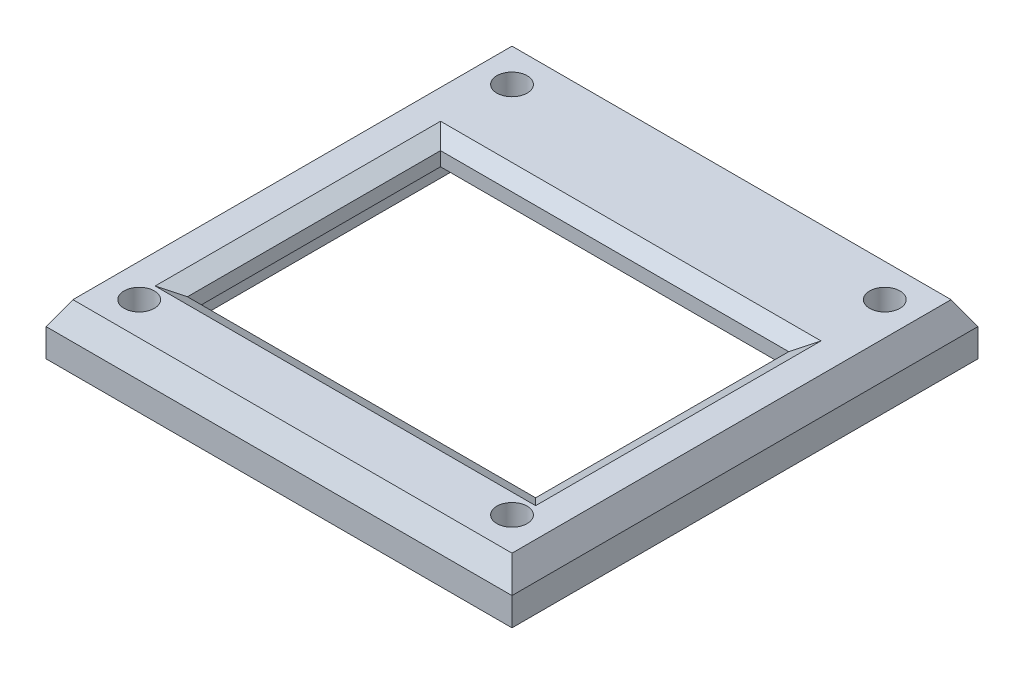
ISO-10303-21;
HEADER;
FILE_DESCRIPTION(('STEP AP214'),'2;1');
FILE_NAME('part.step','',(''),(''),'','','');
FILE_SCHEMA(('AUTOMOTIVE_DESIGN { 1 0 10303 214 1 1 1 1 }'));
ENDSEC;
DATA;
#1=APPLICATION_CONTEXT('core data for automotive mechanical design processes');
#2=APPLICATION_PROTOCOL_DEFINITION('international standard','automotive_design',2000,#1);
#3=PRODUCT_CONTEXT('',#1,'mechanical');
#4=PRODUCT('Part','Part','',(#3));
#5=PRODUCT_RELATED_PRODUCT_CATEGORY('part','',(#4));
#6=PRODUCT_DEFINITION_FORMATION('','',#4);
#7=PRODUCT_DEFINITION_CONTEXT('part definition',#1,'design');
#8=PRODUCT_DEFINITION('design','',#6,#7);
#9=PRODUCT_DEFINITION_SHAPE('','',#8);
#10=(LENGTH_UNIT() NAMED_UNIT(*) SI_UNIT(.MILLI.,.METRE.));
#11=(NAMED_UNIT(*) PLANE_ANGLE_UNIT() SI_UNIT($,.RADIAN.));
#12=(NAMED_UNIT(*) SI_UNIT($,.STERADIAN.) SOLID_ANGLE_UNIT());
#13=UNCERTAINTY_MEASURE_WITH_UNIT(LENGTH_MEASURE(1.E-05),#10,'distance_accuracy_value','');
#14=(GEOMETRIC_REPRESENTATION_CONTEXT(3) GLOBAL_UNCERTAINTY_ASSIGNED_CONTEXT((#13)) GLOBAL_UNIT_ASSIGNED_CONTEXT((#10,
#11,#12)) REPRESENTATION_CONTEXT('',''));
#15=CARTESIAN_POINT('',(0.,0.,0.));
#16=DIRECTION('',(0.,0.,1.));
#17=DIRECTION('',(1.,0.,0.));
#18=AXIS2_PLACEMENT_3D('',#15,#16,#17);
#19=CARTESIAN_POINT('',(0.,3.,-17.475));
#20=DIRECTION('',(0.,0.,-1.));
#21=DIRECTION('',(-1.,0.,0.));
#22=AXIS2_PLACEMENT_3D('',#19,#20,#21);
#23=PLANE('',#22);
#24=DIRECTION('',(1.,0.,0.));
#25=VECTOR('',#24,1.);
#26=CARTESIAN_POINT('',(0.,0.,-17.475));
#27=LINE('',#26,#25);
#28=CARTESIAN_POINT('',(-20.625,0.,-17.475));
#29=VERTEX_POINT('',#28);
#30=CARTESIAN_POINT('',(20.625,0.,-17.475));
#31=VERTEX_POINT('',#30);
#32=EDGE_CURVE('E233',#29,#31,#27,.T.);
#33=ORIENTED_EDGE('',*,*,#32,.T.);
#34=DIRECTION('',(0.,-1.,0.));
#35=VECTOR('',#34,1.);
#36=CARTESIAN_POINT('',(20.625,3.,-17.475));
#37=LINE('',#36,#35);
#38=CARTESIAN_POINT('',(20.625,3.,-17.475));
#39=VERTEX_POINT('',#38);
#40=EDGE_CURVE('E251',#39,#31,#37,.T.);
#41=ORIENTED_EDGE('',*,*,#40,.F.);
#42=DIRECTION('',(1.,0.,0.));
#43=VECTOR('',#42,1.);
#44=CARTESIAN_POINT('',(0.,3.,-17.475));
#45=LINE('',#44,#43);
#46=CARTESIAN_POINT('',(-20.625,3.,-17.475));
#47=VERTEX_POINT('',#46);
#48=EDGE_CURVE('E200',#47,#39,#45,.T.);
#49=ORIENTED_EDGE('',*,*,#48,.F.);
#50=DIRECTION('',(0.,-1.,0.));
#51=VECTOR('',#50,1.);
#52=CARTESIAN_POINT('',(-20.625,3.,-17.475));
#53=LINE('',#52,#51);
#54=EDGE_CURVE('E244',#47,#29,#53,.T.);
#55=ORIENTED_EDGE('',*,*,#54,.T.);
#56=EDGE_LOOP('',(#33,#41,#49,#55));
#57=FACE_BOUND('',#56,.T.);
#58=ADVANCED_FACE('F35',(#57),#23,.F.);
#59=CARTESIAN_POINT('',(20.625,3.,0.));
#60=DIRECTION('',(1.,0.,0.));
#61=DIRECTION('',(0.,0.,-1.));
#62=AXIS2_PLACEMENT_3D('',#59,#60,#61);
#63=PLANE('',#62);
#64=DIRECTION('',(0.,0.,1.));
#65=VECTOR('',#64,1.);
#66=CARTESIAN_POINT('',(20.625,0.,0.));
#67=LINE('',#66,#65);
#68=CARTESIAN_POINT('',(20.625,0.,16.775));
#69=VERTEX_POINT('',#68);
#70=EDGE_CURVE('E236',#31,#69,#67,.T.);
#71=ORIENTED_EDGE('',*,*,#70,.T.);
#72=DIRECTION('',(0.,-1.,0.));
#73=VECTOR('',#72,1.);
#74=CARTESIAN_POINT('',(20.625,3.,16.775));
#75=LINE('',#74,#73);
#76=CARTESIAN_POINT('',(20.625,3.,16.775));
#77=VERTEX_POINT('',#76);
#78=EDGE_CURVE('E249',#77,#69,#75,.T.);
#79=ORIENTED_EDGE('',*,*,#78,.F.);
#80=DIRECTION('',(0.,0.,1.));
#81=VECTOR('',#80,1.);
#82=CARTESIAN_POINT('',(20.625,3.,0.));
#83=LINE('',#82,#81);
#84=EDGE_CURVE('E202',#39,#77,#83,.T.);
#85=ORIENTED_EDGE('',*,*,#84,.F.);
#86=ORIENTED_EDGE('',*,*,#40,.T.);
#87=EDGE_LOOP('',(#71,#79,#85,#86));
#88=FACE_BOUND('',#87,.T.);
#89=ADVANCED_FACE('F327',(#88),#63,.F.);
#90=CARTESIAN_POINT('',(0.,3.,16.775));
#91=DIRECTION('',(0.,0.,-1.));
#92=DIRECTION('',(-1.,0.,0.));
#93=AXIS2_PLACEMENT_3D('',#90,#91,#92);
#94=PLANE('',#93);
#95=DIRECTION('',(1.,0.,0.));
#96=VECTOR('',#95,1.);
#97=CARTESIAN_POINT('',(0.,0.,16.775));
#98=LINE('',#97,#96);
#99=CARTESIAN_POINT('',(-20.625,0.,16.775));
#100=VERTEX_POINT('',#99);
#101=EDGE_CURVE('E239',#100,#69,#98,.T.);
#102=ORIENTED_EDGE('',*,*,#101,.F.);
#103=DIRECTION('',(0.,-1.,0.));
#104=VECTOR('',#103,1.);
#105=CARTESIAN_POINT('',(-20.625,3.,16.775));
#106=LINE('',#105,#104);
#107=CARTESIAN_POINT('',(-20.625,3.,16.775));
#108=VERTEX_POINT('',#107);
#109=EDGE_CURVE('E246',#108,#100,#106,.T.);
#110=ORIENTED_EDGE('',*,*,#109,.F.);
#111=DIRECTION('',(1.,0.,0.));
#112=VECTOR('',#111,1.);
#113=CARTESIAN_POINT('',(0.,3.,16.775));
#114=LINE('',#113,#112);
#115=EDGE_CURVE('E204',#108,#77,#114,.T.);
#116=ORIENTED_EDGE('',*,*,#115,.T.);
#117=ORIENTED_EDGE('',*,*,#78,.T.);
#118=EDGE_LOOP('',(#102,#110,#116,#117));
#119=FACE_BOUND('',#118,.T.);
#120=ADVANCED_FACE('F333',(#119),#94,.T.);
#121=CARTESIAN_POINT('',(25.,3.,0.));
#122=DIRECTION('',(1.,0.,0.));
#123=DIRECTION('',(0.,0.,-1.));
#124=AXIS2_PLACEMENT_3D('',#121,#122,#123);
#125=PLANE('',#124);
#126=DIRECTION('',(0.,0.,1.));
#127=VECTOR('',#126,1.);
#128=CARTESIAN_POINT('',(25.,0.,0.));
#129=LINE('',#128,#127);
#130=CARTESIAN_POINT('',(25.,0.,-25.));
#131=VERTEX_POINT('',#130);
#132=CARTESIAN_POINT('',(25.,0.,25.));
#133=VERTEX_POINT('',#132);
#134=EDGE_CURVE('E159',#131,#133,#129,.T.);
#135=ORIENTED_EDGE('',*,*,#134,.F.);
#136=DIRECTION('',(0.,-1.,0.));
#137=VECTOR('',#136,1.);
#138=CARTESIAN_POINT('',(25.,3.,-25.));
#139=LINE('',#138,#137);
#140=CARTESIAN_POINT('',(25.,3.,-25.));
#141=VERTEX_POINT('',#140);
#142=EDGE_CURVE('E247',#141,#131,#139,.T.);
#143=ORIENTED_EDGE('',*,*,#142,.F.);
#144=DIRECTION('',(0.,0.,1.));
#145=VECTOR('',#144,1.);
#146=CARTESIAN_POINT('',(25.,3.,0.));
#147=LINE('',#146,#145);
#148=CARTESIAN_POINT('',(25.,3.,25.));
#149=VERTEX_POINT('',#148);
#150=EDGE_CURVE('E187',#141,#149,#147,.T.);
#151=ORIENTED_EDGE('',*,*,#150,.T.);
#152=DIRECTION('',(0.,-1.,0.));
#153=VECTOR('',#152,1.);
#154=CARTESIAN_POINT('',(25.,3.,25.));
#155=LINE('',#154,#153);
#156=EDGE_CURVE('E210',#149,#133,#155,.T.);
#157=ORIENTED_EDGE('',*,*,#156,.T.);
#158=EDGE_LOOP('',(#135,#143,#151,#157));
#159=FACE_BOUND('',#158,.T.);
#160=ADVANCED_FACE('F366',(#159),#125,.T.);
#161=CARTESIAN_POINT('',(0.,3.,-25.));
#162=DIRECTION('',(0.,0.,-1.));
#163=DIRECTION('',(-1.,0.,0.));
#164=AXIS2_PLACEMENT_3D('',#161,#162,#163);
#165=PLANE('',#164);
#166=DIRECTION('',(1.,0.,0.));
#167=VECTOR('',#166,1.);
#168=CARTESIAN_POINT('',(0.,0.,-25.));
#169=LINE('',#168,#167);
#170=CARTESIAN_POINT('',(-25.,0.,-25.));
#171=VERTEX_POINT('',#170);
#172=EDGE_CURVE('E213',#171,#131,#169,.T.);
#173=ORIENTED_EDGE('',*,*,#172,.F.);
#174=DIRECTION('',(0.,-1.,0.));
#175=VECTOR('',#174,1.);
#176=CARTESIAN_POINT('',(-25.,3.,-25.));
#177=LINE('',#176,#175);
#178=CARTESIAN_POINT('',(-25.,3.,-25.));
#179=VERTEX_POINT('',#178);
#180=EDGE_CURVE('E259',#179,#171,#177,.T.);
#181=ORIENTED_EDGE('',*,*,#180,.F.);
#182=DIRECTION('',(1.,0.,0.));
#183=VECTOR('',#182,1.);
#184=CARTESIAN_POINT('',(0.,3.,-25.));
#185=LINE('',#184,#183);
#186=EDGE_CURVE('E190',#179,#141,#185,.T.);
#187=ORIENTED_EDGE('',*,*,#186,.T.);
#188=ORIENTED_EDGE('',*,*,#142,.T.);
#189=EDGE_LOOP('',(#173,#181,#187,#188));
#190=FACE_BOUND('',#189,.T.);
#191=ADVANCED_FACE('F362',(#190),#165,.T.);
#192=CARTESIAN_POINT('',(-25.,3.,0.));
#193=DIRECTION('',(1.,0.,0.));
#194=DIRECTION('',(0.,0.,-1.));
#195=AXIS2_PLACEMENT_3D('',#192,#193,#194);
#196=PLANE('',#195);
#197=DIRECTION('',(0.,0.,1.));
#198=VECTOR('',#197,1.);
#199=CARTESIAN_POINT('',(-25.,0.,0.));
#200=LINE('',#199,#198);
#201=CARTESIAN_POINT('',(-25.,0.,25.));
#202=VERTEX_POINT('',#201);
#203=EDGE_CURVE('E216',#171,#202,#200,.T.);
#204=ORIENTED_EDGE('',*,*,#203,.T.);
#205=DIRECTION('',(0.,-1.,0.));
#206=VECTOR('',#205,1.);
#207=CARTESIAN_POINT('',(-25.,3.,25.));
#208=LINE('',#207,#206);
#209=CARTESIAN_POINT('',(-25.,3.,25.));
#210=VERTEX_POINT('',#209);
#211=EDGE_CURVE('E256',#210,#202,#208,.T.);
#212=ORIENTED_EDGE('',*,*,#211,.F.);
#213=DIRECTION('',(0.,0.,1.));
#214=VECTOR('',#213,1.);
#215=CARTESIAN_POINT('',(-25.,3.,0.));
#216=LINE('',#215,#214);
#217=EDGE_CURVE('E194',#179,#210,#216,.T.);
#218=ORIENTED_EDGE('',*,*,#217,.F.);
#219=ORIENTED_EDGE('',*,*,#180,.T.);
#220=EDGE_LOOP('',(#204,#212,#218,#219));
#221=FACE_BOUND('',#220,.T.);
#222=ADVANCED_FACE('F342',(#221),#196,.F.);
#223=CARTESIAN_POINT('',(-20.,3.,-20.));
#224=DIRECTION('',(0.,-1.,0.));
#225=DIRECTION('',(0.,0.,-1.));
#226=AXIS2_PLACEMENT_3D('',#223,#224,#225);
#227=CYLINDRICAL_SURFACE('',#226,1.625);
#228=CARTESIAN_POINT('',(-20.,0.,-20.));
#229=DIRECTION('',(0.,1.,0.));
#230=DIRECTION('',(0.,0.,1.));
#231=AXIS2_PLACEMENT_3D('',#228,#229,#230);
#232=CIRCLE('',#231,1.625);
#233=CARTESIAN_POINT('',(-20.,0.,-18.375));
#234=VERTEX_POINT('',#233);
#235=EDGE_CURVE('E230',#234,#234,#232,.T.);
#236=ORIENTED_EDGE('',*,*,#235,.F.);
#237=EDGE_LOOP('',(#236));
#238=FACE_BOUND('',#237,.T.);
#239=CARTESIAN_POINT('',(-20.,5.5,-20.));
#240=DIRECTION('',(0.,1.,0.));
#241=DIRECTION('',(0.,0.,1.));
#242=AXIS2_PLACEMENT_3D('',#239,#240,#241);
#243=CIRCLE('',#242,1.625);
#244=CARTESIAN_POINT('',(-20.,5.5,-18.375));
#245=VERTEX_POINT('',#244);
#246=EDGE_CURVE('E184',#245,#245,#243,.T.);
#247=ORIENTED_EDGE('',*,*,#246,.T.);
#248=EDGE_LOOP('',(#247));
#249=FACE_BOUND('',#248,.T.);
#250=ADVANCED_FACE('F338',(#238,#249),#227,.F.);
#251=CARTESIAN_POINT('',(20.,3.,-20.));
#252=DIRECTION('',(0.,-1.,0.));
#253=DIRECTION('',(0.,0.,-1.));
#254=AXIS2_PLACEMENT_3D('',#251,#252,#253);
#255=CYLINDRICAL_SURFACE('',#254,1.625);
#256=CARTESIAN_POINT('',(20.,0.,-20.));
#257=DIRECTION('',(0.,1.,0.));
#258=DIRECTION('',(0.,0.,1.));
#259=AXIS2_PLACEMENT_3D('',#256,#257,#258);
#260=CIRCLE('',#259,1.625);
#261=CARTESIAN_POINT('',(20.,0.,-18.375));
#262=VERTEX_POINT('',#261);
#263=EDGE_CURVE('E227',#262,#262,#260,.T.);
#264=ORIENTED_EDGE('',*,*,#263,.F.);
#265=EDGE_LOOP('',(#264));
#266=FACE_BOUND('',#265,.T.);
#267=CARTESIAN_POINT('',(20.,5.5,-20.));
#268=DIRECTION('',(0.,1.,0.));
#269=DIRECTION('',(0.,0.,1.));
#270=AXIS2_PLACEMENT_3D('',#267,#268,#269);
#271=CIRCLE('',#270,1.625);
#272=CARTESIAN_POINT('',(20.,5.5,-18.375));
#273=VERTEX_POINT('',#272);
#274=EDGE_CURVE('E580',#273,#273,#271,.T.);
#275=ORIENTED_EDGE('',*,*,#274,.T.);
#276=EDGE_LOOP('',(#275));
#277=FACE_BOUND('',#276,.T.);
#278=ADVANCED_FACE('F341',(#266,#277),#255,.F.);
#279=CARTESIAN_POINT('',(20.,3.,20.));
#280=DIRECTION('',(0.,-1.,0.));
#281=DIRECTION('',(0.,0.,-1.));
#282=AXIS2_PLACEMENT_3D('',#279,#280,#281);
#283=CYLINDRICAL_SURFACE('',#282,1.625);
#284=CARTESIAN_POINT('',(20.,0.,20.));
#285=DIRECTION('',(0.,1.,0.));
#286=DIRECTION('',(0.,0.,1.));
#287=AXIS2_PLACEMENT_3D('',#284,#285,#286);
#288=CIRCLE('',#287,1.625);
#289=CARTESIAN_POINT('',(20.,0.,21.625));
#290=VERTEX_POINT('',#289);
#291=EDGE_CURVE('E224',#290,#290,#288,.T.);
#292=ORIENTED_EDGE('',*,*,#291,.F.);
#293=EDGE_LOOP('',(#292));
#294=FACE_BOUND('',#293,.T.);
#295=CARTESIAN_POINT('',(20.,5.5,20.));
#296=DIRECTION('',(0.,1.,0.));
#297=DIRECTION('',(0.,0.,1.));
#298=AXIS2_PLACEMENT_3D('',#295,#296,#297);
#299=CIRCLE('',#298,1.625);
#300=CARTESIAN_POINT('',(20.,5.5,21.625));
#301=VERTEX_POINT('',#300);
#302=EDGE_CURVE('E582',#301,#301,#299,.T.);
#303=ORIENTED_EDGE('',*,*,#302,.T.);
#304=EDGE_LOOP('',(#303));
#305=FACE_BOUND('',#304,.T.);
#306=ADVANCED_FACE('F346',(#294,#305),#283,.F.);
#307=CARTESIAN_POINT('',(-20.,3.,20.));
#308=DIRECTION('',(0.,-1.,0.));
#309=DIRECTION('',(0.,0.,-1.));
#310=AXIS2_PLACEMENT_3D('',#307,#308,#309);
#311=CYLINDRICAL_SURFACE('',#310,1.625);
#312=CARTESIAN_POINT('',(-20.,0.,20.));
#313=DIRECTION('',(0.,1.,0.));
#314=DIRECTION('',(0.,0.,1.));
#315=AXIS2_PLACEMENT_3D('',#312,#313,#314);
#316=CIRCLE('',#315,1.625);
#317=CARTESIAN_POINT('',(-20.,0.,21.625));
#318=VERTEX_POINT('',#317);
#319=EDGE_CURVE('E221',#318,#318,#316,.T.);
#320=ORIENTED_EDGE('',*,*,#319,.F.);
#321=EDGE_LOOP('',(#320));
#322=FACE_BOUND('',#321,.T.);
#323=CARTESIAN_POINT('',(-20.,5.5,20.));
#324=DIRECTION('',(0.,1.,0.));
#325=DIRECTION('',(0.,0.,1.));
#326=AXIS2_PLACEMENT_3D('',#323,#324,#325);
#327=CIRCLE('',#326,1.625);
#328=CARTESIAN_POINT('',(-20.,5.5,21.625));
#329=VERTEX_POINT('',#328);
#330=EDGE_CURVE('E181',#329,#329,#327,.T.);
#331=ORIENTED_EDGE('',*,*,#330,.T.);
#332=EDGE_LOOP('',(#331));
#333=FACE_BOUND('',#332,.T.);
#334=ADVANCED_FACE('F350',(#322,#333),#311,.F.);
#335=CARTESIAN_POINT('',(0.,3.,25.));
#336=DIRECTION('',(0.,0.,-1.));
#337=DIRECTION('',(-1.,0.,0.));
#338=AXIS2_PLACEMENT_3D('',#335,#336,#337);
#339=PLANE('',#338);
#340=DIRECTION('',(1.,0.,0.));
#341=VECTOR('',#340,1.);
#342=CARTESIAN_POINT('',(0.,0.,25.));
#343=LINE('',#342,#341);
#344=EDGE_CURVE('E218',#202,#133,#343,.T.);
#345=ORIENTED_EDGE('',*,*,#344,.T.);
#346=ORIENTED_EDGE('',*,*,#156,.F.);
#347=DIRECTION('',(1.,0.,0.));
#348=VECTOR('',#347,1.);
#349=CARTESIAN_POINT('',(0.,3.,25.));
#350=LINE('',#349,#348);
#351=EDGE_CURVE('E197',#210,#149,#350,.T.);
#352=ORIENTED_EDGE('',*,*,#351,.F.);
#353=ORIENTED_EDGE('',*,*,#211,.T.);
#354=EDGE_LOOP('',(#345,#346,#352,#353));
#355=FACE_BOUND('',#354,.T.);
#356=ADVANCED_FACE('F354',(#355),#339,.F.);
#357=CARTESIAN_POINT('',(-20.625,3.,0.));
#358=DIRECTION('',(1.,0.,0.));
#359=DIRECTION('',(0.,0.,-1.));
#360=AXIS2_PLACEMENT_3D('',#357,#358,#359);
#361=PLANE('',#360);
#362=DIRECTION('',(0.,0.,1.));
#363=VECTOR('',#362,1.);
#364=CARTESIAN_POINT('',(-20.625,0.,0.));
#365=LINE('',#364,#363);
#366=EDGE_CURVE('E191',#29,#100,#365,.T.);
#367=ORIENTED_EDGE('',*,*,#366,.F.);
#368=ORIENTED_EDGE('',*,*,#54,.F.);
#369=DIRECTION('',(0.,0.,1.));
#370=VECTOR('',#369,1.);
#371=CARTESIAN_POINT('',(-20.625,3.,0.));
#372=LINE('',#371,#370);
#373=EDGE_CURVE('E207',#47,#108,#372,.T.);
#374=ORIENTED_EDGE('',*,*,#373,.T.);
#375=ORIENTED_EDGE('',*,*,#109,.T.);
#376=EDGE_LOOP('',(#367,#368,#374,#375));
#377=FACE_BOUND('',#376,.T.);
#378=ADVANCED_FACE('F358',(#377),#361,.T.);
#379=CARTESIAN_POINT('',(0.,0.,0.));
#380=DIRECTION('',(0.,1.,0.));
#381=DIRECTION('',(0.,0.,1.));
#382=AXIS2_PLACEMENT_3D('',#379,#380,#381);
#383=PLANE('',#382);
#384=ORIENTED_EDGE('',*,*,#134,.T.);
#385=ORIENTED_EDGE('',*,*,#344,.F.);
#386=ORIENTED_EDGE('',*,*,#203,.F.);
#387=ORIENTED_EDGE('',*,*,#172,.T.);
#388=EDGE_LOOP('',(#384,#385,#386,#387));
#389=FACE_BOUND('',#388,.T.);
#390=ORIENTED_EDGE('',*,*,#319,.T.);
#391=EDGE_LOOP('',(#390));
#392=FACE_BOUND('',#391,.T.);
#393=ORIENTED_EDGE('',*,*,#291,.T.);
#394=EDGE_LOOP('',(#393));
#395=FACE_BOUND('',#394,.T.);
#396=ORIENTED_EDGE('',*,*,#263,.T.);
#397=EDGE_LOOP('',(#396));
#398=FACE_BOUND('',#397,.T.);
#399=ORIENTED_EDGE('',*,*,#235,.T.);
#400=EDGE_LOOP('',(#399));
#401=FACE_BOUND('',#400,.T.);
#402=ORIENTED_EDGE('',*,*,#32,.F.);
#403=ORIENTED_EDGE('',*,*,#366,.T.);
#404=ORIENTED_EDGE('',*,*,#101,.T.);
#405=ORIENTED_EDGE('',*,*,#70,.F.);
#406=EDGE_LOOP('',(#402,#403,#404,#405));
#407=FACE_BOUND('',#406,.T.);
#408=ADVANCED_FACE('F451',(#389,#392,#395,#398,#401,#407),#383,.F.);
#409=CARTESIAN_POINT('',(0.,3.,0.));
#410=DIRECTION('',(0.,1.,0.));
#411=DIRECTION('',(0.,0.,1.));
#412=AXIS2_PLACEMENT_3D('',#409,#410,#411);
#413=PLANE('',#412);
#414=DIRECTION('',(0.,0.,1.));
#415=VECTOR('',#414,1.);
#416=CARTESIAN_POINT('',(-18.6812981483655,3.,0.));
#417=LINE('',#416,#415);
#418=CARTESIAN_POINT('',(-18.6812981483655,3.,-11.0120511529388));
#419=VERTEX_POINT('',#418);
#420=CARTESIAN_POINT('',(-18.6812981483655,3.,16.145625286935));
#421=VERTEX_POINT('',#420);
#422=EDGE_CURVE('E163',#419,#421,#417,.T.);
#423=ORIENTED_EDGE('',*,*,#422,.T.);
#424=DIRECTION('',(-1.,0.,0.));
#425=VECTOR('',#424,1.);
#426=CARTESIAN_POINT('',(0.,3.,16.145625286935));
#427=LINE('',#426,#425);
#428=CARTESIAN_POINT('',(18.6812981483655,3.,16.145625286935));
#429=VERTEX_POINT('',#428);
#430=EDGE_CURVE('E176',#429,#421,#427,.T.);
#431=ORIENTED_EDGE('',*,*,#430,.F.);
#432=DIRECTION('',(0.,0.,-1.));
#433=VECTOR('',#432,1.);
#434=CARTESIAN_POINT('',(18.6812981483655,3.,0.));
#435=LINE('',#434,#433);
#436=CARTESIAN_POINT('',(18.6812981483655,3.,-11.0120511529388));
#437=VERTEX_POINT('',#436);
#438=EDGE_CURVE('E174',#429,#437,#435,.T.);
#439=ORIENTED_EDGE('',*,*,#438,.T.);
#440=DIRECTION('',(-1.,0.,0.));
#441=VECTOR('',#440,1.);
#442=CARTESIAN_POINT('',(0.,3.,-11.0120511529388));
#443=LINE('',#442,#441);
#444=EDGE_CURVE('E152',#437,#419,#443,.T.);
#445=ORIENTED_EDGE('',*,*,#444,.T.);
#446=EDGE_LOOP('',(#423,#431,#439,#445));
#447=FACE_BOUND('',#446,.T.);
#448=ORIENTED_EDGE('',*,*,#373,.F.);
#449=ORIENTED_EDGE('',*,*,#48,.T.);
#450=ORIENTED_EDGE('',*,*,#84,.T.);
#451=ORIENTED_EDGE('',*,*,#115,.F.);
#452=EDGE_LOOP('',(#448,#449,#450,#451));
#453=FACE_BOUND('',#452,.T.);
#454=ADVANCED_FACE('F171',(#447,#453),#413,.F.);
#455=CARTESIAN_POINT('',(-18.6812981483655,5.5,0.));
#456=DIRECTION('',(1.,0.,0.));
#457=DIRECTION('',(0.,0.,-1.));
#458=AXIS2_PLACEMENT_3D('',#455,#456,#457);
#459=PLANE('',#458);
#460=DIRECTION('',(0.,-1.,0.));
#461=VECTOR('',#460,1.);
#462=CARTESIAN_POINT('',(-18.6812981483655,5.5,-11.0120511529388));
#463=LINE('',#462,#461);
#464=CARTESIAN_POINT('',(-18.6812981483655,4.5,-11.0120511529388));
#465=VERTEX_POINT('',#464);
#466=EDGE_CURVE('E148',#465,#419,#463,.T.);
#467=ORIENTED_EDGE('',*,*,#466,.F.);
#468=DIRECTION('',(0.,0.,1.));
#469=VECTOR('',#468,1.);
#470=CARTESIAN_POINT('',(-18.6812981483655,4.5,0.));
#471=LINE('',#470,#469);
#472=CARTESIAN_POINT('',(-18.6812981483655,4.5,16.145625286935));
#473=VERTEX_POINT('',#472);
#474=EDGE_CURVE('E270',#465,#473,#471,.T.);
#475=ORIENTED_EDGE('',*,*,#474,.T.);
#476=DIRECTION('',(0.,-1.,0.));
#477=VECTOR('',#476,1.);
#478=CARTESIAN_POINT('',(-18.6812981483655,5.5,16.145625286935));
#479=LINE('',#478,#477);
#480=EDGE_CURVE('E165',#473,#421,#479,.T.);
#481=ORIENTED_EDGE('',*,*,#480,.T.);
#482=ORIENTED_EDGE('',*,*,#422,.F.);
#483=EDGE_LOOP('',(#467,#475,#481,#482));
#484=FACE_BOUND('',#483,.T.);
#485=ADVANCED_FACE('F164',(#484),#459,.T.);
#486=CARTESIAN_POINT('',(0.,5.5,-11.0120511529388));
#487=DIRECTION('',(0.,0.,1.));
#488=DIRECTION('',(1.,0.,0.));
#489=AXIS2_PLACEMENT_3D('',#486,#487,#488);
#490=PLANE('',#489);
#491=DIRECTION('',(0.,-1.,0.));
#492=VECTOR('',#491,1.);
#493=CARTESIAN_POINT('',(18.6812981483655,5.5,-11.0120511529388));
#494=LINE('',#493,#492);
#495=CARTESIAN_POINT('',(18.6812981483655,4.5,-11.0120511529388));
#496=VERTEX_POINT('',#495);
#497=EDGE_CURVE('E160',#496,#437,#494,.T.);
#498=ORIENTED_EDGE('',*,*,#497,.F.);
#499=DIRECTION('',(-1.,0.,0.));
#500=VECTOR('',#499,1.);
#501=CARTESIAN_POINT('',(0.,4.5,-11.0120511529388));
#502=LINE('',#501,#500);
#503=EDGE_CURVE('E155',#496,#465,#502,.T.);
#504=ORIENTED_EDGE('',*,*,#503,.T.);
#505=ORIENTED_EDGE('',*,*,#466,.T.);
#506=ORIENTED_EDGE('',*,*,#444,.F.);
#507=EDGE_LOOP('',(#498,#504,#505,#506));
#508=FACE_BOUND('',#507,.T.);
#509=ADVANCED_FACE('F150',(#508),#490,.T.);
#510=CARTESIAN_POINT('',(18.6812981483655,5.5,0.));
#511=DIRECTION('',(-1.,0.,0.));
#512=DIRECTION('',(0.,0.,1.));
#513=AXIS2_PLACEMENT_3D('',#510,#511,#512);
#514=PLANE('',#513);
#515=DIRECTION('',(0.,-1.,0.));
#516=VECTOR('',#515,1.);
#517=CARTESIAN_POINT('',(18.6812981483655,5.5,16.145625286935));
#518=LINE('',#517,#516);
#519=CARTESIAN_POINT('',(18.6812981483655,4.5,16.145625286935));
#520=VERTEX_POINT('',#519);
#521=EDGE_CURVE('E183',#520,#429,#518,.T.);
#522=ORIENTED_EDGE('',*,*,#521,.F.);
#523=DIRECTION('',(0.,0.,-1.));
#524=VECTOR('',#523,1.);
#525=CARTESIAN_POINT('',(18.6812981483655,4.5,0.));
#526=LINE('',#525,#524);
#527=EDGE_CURVE('E44',#520,#496,#526,.T.);
#528=ORIENTED_EDGE('',*,*,#527,.T.);
#529=ORIENTED_EDGE('',*,*,#497,.T.);
#530=ORIENTED_EDGE('',*,*,#438,.F.);
#531=EDGE_LOOP('',(#522,#528,#529,#530));
#532=FACE_BOUND('',#531,.T.);
#533=ADVANCED_FACE('F317',(#532),#514,.T.);
#534=CARTESIAN_POINT('',(0.,5.5,16.145625286935));
#535=DIRECTION('',(0.,0.,1.));
#536=DIRECTION('',(1.,0.,0.));
#537=AXIS2_PLACEMENT_3D('',#534,#535,#536);
#538=PLANE('',#537);
#539=ORIENTED_EDGE('',*,*,#480,.F.);
#540=DIRECTION('',(1.,0.,0.));
#541=VECTOR('',#540,1.);
#542=CARTESIAN_POINT('',(18.6812981483655,4.5,16.145625286935));
#543=LINE('',#542,#541);
#544=EDGE_CURVE('E11',#473,#520,#543,.T.);
#545=ORIENTED_EDGE('',*,*,#544,.T.);
#546=ORIENTED_EDGE('',*,*,#521,.T.);
#547=ORIENTED_EDGE('',*,*,#430,.T.);
#548=EDGE_LOOP('',(#539,#545,#546,#547));
#549=FACE_BOUND('',#548,.T.);
#550=ADVANCED_FACE('F316',(#549),#538,.F.);
#551=CARTESIAN_POINT('',(0.,5.5,0.));
#552=DIRECTION('',(0.,1.,0.));
#553=DIRECTION('',(0.,0.,1.));
#554=AXIS2_PLACEMENT_3D('',#551,#552,#553);
#555=PLANE('',#554);
#556=DIRECTION('',(-1.,0.,0.));
#557=VECTOR('',#556,1.);
#558=CARTESIAN_POINT('',(-18.6812981483655,5.5,17.8776760945038));
#559=LINE('',#558,#557);
#560=CARTESIAN_POINT('',(20.4133489559344,5.5,17.8776760945038));
#561=VERTEX_POINT('',#560);
#562=CARTESIAN_POINT('',(-20.4133489559344,5.5,17.8776760945038));
#563=VERTEX_POINT('',#562);
#564=EDGE_CURVE('E281',#561,#563,#559,.T.);
#565=ORIENTED_EDGE('',*,*,#564,.T.);
#566=DIRECTION('',(0.,0.,-1.));
#567=VECTOR('',#566,1.);
#568=CARTESIAN_POINT('',(-20.4133489559344,5.5,0.));
#569=LINE('',#568,#567);
#570=CARTESIAN_POINT('',(-20.4133489559344,5.5,-12.7441019605077));
#571=VERTEX_POINT('',#570);
#572=EDGE_CURVE('E287',#563,#571,#569,.T.);
#573=ORIENTED_EDGE('',*,*,#572,.T.);
#574=DIRECTION('',(1.,0.,0.));
#575=VECTOR('',#574,1.);
#576=CARTESIAN_POINT('',(0.,5.5,-12.7441019605077));
#577=LINE('',#576,#575);
#578=CARTESIAN_POINT('',(20.4133489559344,5.5,-12.7441019605077));
#579=VERTEX_POINT('',#578);
#580=EDGE_CURVE('E285',#571,#579,#577,.T.);
#581=ORIENTED_EDGE('',*,*,#580,.T.);
#582=DIRECTION('',(0.,0.,1.));
#583=VECTOR('',#582,1.);
#584=CARTESIAN_POINT('',(20.4133489559344,5.5,0.));
#585=LINE('',#584,#583);
#586=EDGE_CURVE('E283',#579,#561,#585,.T.);
#587=ORIENTED_EDGE('',*,*,#586,.T.);
#588=EDGE_LOOP('',(#565,#573,#581,#587));
#589=FACE_BOUND('',#588,.T.);
#590=DIRECTION('',(1.,0.,0.));
#591=VECTOR('',#590,1.);
#592=CARTESIAN_POINT('',(0.,5.5,23.5566243270259));
#593=LINE('',#592,#591);
#594=CARTESIAN_POINT('',(-23.556624327026,5.5,23.5566243270259));
#595=VERTEX_POINT('',#594);
#596=CARTESIAN_POINT('',(23.556624327026,5.5,23.5566243270259));
#597=VERTEX_POINT('',#596);
#598=EDGE_CURVE('E266',#595,#597,#593,.T.);
#599=ORIENTED_EDGE('',*,*,#598,.T.);
#600=DIRECTION('',(0.,0.,1.));
#601=VECTOR('',#600,1.);
#602=CARTESIAN_POINT('',(23.556624327026,5.5,0.));
#603=LINE('',#602,#601);
#604=CARTESIAN_POINT('',(23.556624327026,5.5,-23.556624327026));
#605=VERTEX_POINT('',#604);
#606=EDGE_CURVE('E268',#597,#605,#603,.F.);
#607=ORIENTED_EDGE('',*,*,#606,.T.);
#608=DIRECTION('',(1.,0.,0.));
#609=VECTOR('',#608,1.);
#610=CARTESIAN_POINT('',(0.,5.5,-23.556624327026));
#611=LINE('',#610,#609);
#612=CARTESIAN_POINT('',(-23.556624327026,5.5,-23.556624327026));
#613=VERTEX_POINT('',#612);
#614=EDGE_CURVE('E254',#605,#613,#611,.F.);
#615=ORIENTED_EDGE('',*,*,#614,.T.);
#616=DIRECTION('',(0.,0.,1.));
#617=VECTOR('',#616,1.);
#618=CARTESIAN_POINT('',(-23.556624327026,5.5,0.));
#619=LINE('',#618,#617);
#620=EDGE_CURVE('E264',#613,#595,#619,.T.);
#621=ORIENTED_EDGE('',*,*,#620,.T.);
#622=EDGE_LOOP('',(#599,#607,#615,#621));
#623=FACE_BOUND('',#622,.T.);
#624=ORIENTED_EDGE('',*,*,#330,.F.);
#625=EDGE_LOOP('',(#624));
#626=FACE_BOUND('',#625,.T.);
#627=ORIENTED_EDGE('',*,*,#302,.F.);
#628=EDGE_LOOP('',(#627));
#629=FACE_BOUND('',#628,.T.);
#630=ORIENTED_EDGE('',*,*,#274,.F.);
#631=EDGE_LOOP('',(#630));
#632=FACE_BOUND('',#631,.T.);
#633=ORIENTED_EDGE('',*,*,#246,.F.);
#634=EDGE_LOOP('',(#633));
#635=FACE_BOUND('',#634,.T.);
#636=ADVANCED_FACE('F308',(#589,#623,#626,#629,#632,#635),#555,.T.);
#637=CARTESIAN_POINT('',(0.,6.46410161513783,23.));
#638=DIRECTION('',(0.,-0.499999999999996,-0.866025403784441));
#639=DIRECTION('',(1.,0.,0.));
#640=AXIS2_PLACEMENT_3D('',#637,#638,#639);
#641=PLANE('',#640);
#642=DIRECTION('',(0.447213595499955,-0.774596669241487,0.447213595499955));
#643=VECTOR('',#642,1.);
#644=CARTESIAN_POINT('',(18.4000000000001,14.4315353299546,18.4));
#645=LINE('',#644,#643);
#646=EDGE_CURVE('E275',#597,#149,#645,.T.);
#647=ORIENTED_EDGE('',*,*,#646,.F.);
#648=ORIENTED_EDGE('',*,*,#598,.F.);
#649=DIRECTION('',(0.447213595499955,0.774596669241487,-0.447213595499955));
#650=VECTOR('',#649,1.);
#651=CARTESIAN_POINT('',(-18.4000000000001,14.4315353299546,18.4));
#652=LINE('',#651,#650);
#653=EDGE_CURVE('E169',#210,#595,#652,.T.);
#654=ORIENTED_EDGE('',*,*,#653,.F.);
#655=ORIENTED_EDGE('',*,*,#351,.T.);
#656=EDGE_LOOP('',(#647,#648,#654,#655));
#657=FACE_BOUND('',#656,.T.);
#658=ADVANCED_FACE('F382',(#657),#641,.F.);
#659=CARTESIAN_POINT('',(-23.,6.46410161513783,0.));
#660=DIRECTION('',(0.866025403784441,-0.499999999999996,0.));
#661=DIRECTION('',(0.,0.,1.));
#662=AXIS2_PLACEMENT_3D('',#659,#660,#661);
#663=PLANE('',#662);
#664=ORIENTED_EDGE('',*,*,#653,.T.);
#665=ORIENTED_EDGE('',*,*,#620,.F.);
#666=DIRECTION('',(-0.447213595499955,-0.774596669241487,-0.447213595499955));
#667=VECTOR('',#666,1.);
#668=CARTESIAN_POINT('',(-20.0000000000001,11.6602540378444,-20.0000000000001));
#669=LINE('',#668,#667);
#670=EDGE_CURVE('E273',#179,#613,#669,.F.);
#671=ORIENTED_EDGE('',*,*,#670,.F.);
#672=ORIENTED_EDGE('',*,*,#217,.T.);
#673=EDGE_LOOP('',(#664,#665,#671,#672));
#674=FACE_BOUND('',#673,.T.);
#675=ADVANCED_FACE('F378',(#674),#663,.F.);
#676=CARTESIAN_POINT('',(25.,3.,0.));
#677=DIRECTION('',(0.866025403784441,0.499999999999996,0.));
#678=DIRECTION('',(0.,0.,-1.));
#679=AXIS2_PLACEMENT_3D('',#676,#677,#678);
#680=PLANE('',#679);
#681=ORIENTED_EDGE('',*,*,#646,.T.);
#682=ORIENTED_EDGE('',*,*,#150,.F.);
#683=DIRECTION('',(0.447213595499955,-0.774596669241487,-0.447213595499955));
#684=VECTOR('',#683,1.);
#685=CARTESIAN_POINT('',(20.0000000000001,11.6602540378444,-20.0000000000001));
#686=LINE('',#685,#684);
#687=EDGE_CURVE('E271',#605,#141,#686,.T.);
#688=ORIENTED_EDGE('',*,*,#687,.F.);
#689=ORIENTED_EDGE('',*,*,#606,.F.);
#690=EDGE_LOOP('',(#681,#682,#688,#689));
#691=FACE_BOUND('',#690,.T.);
#692=ADVANCED_FACE('F374',(#691),#680,.T.);
#693=CARTESIAN_POINT('',(0.,3.,-25.));
#694=DIRECTION('',(0.,0.499999999999996,-0.866025403784441));
#695=DIRECTION('',(-1.,0.,0.));
#696=AXIS2_PLACEMENT_3D('',#693,#694,#695);
#697=PLANE('',#696);
#698=ORIENTED_EDGE('',*,*,#670,.T.);
#699=ORIENTED_EDGE('',*,*,#614,.F.);
#700=ORIENTED_EDGE('',*,*,#687,.T.);
#701=ORIENTED_EDGE('',*,*,#186,.F.);
#702=EDGE_LOOP('',(#698,#699,#700,#701));
#703=FACE_BOUND('',#702,.T.);
#704=ADVANCED_FACE('F371',(#703),#697,.T.);
#705=CARTESIAN_POINT('',(18.6812981483655,4.5,0.));
#706=DIRECTION('',(0.500000000000005,-0.866025403784436,0.));
#707=DIRECTION('',(0.,0.,-1.));
#708=AXIS2_PLACEMENT_3D('',#705,#706,#707);
#709=PLANE('',#708);
#710=DIRECTION('',(0.654653670707976,0.377964473009231,0.654653670707976));
#711=VECTOR('',#710,1.);
#712=CARTESIAN_POINT('',(11.7617444539648,0.504993811865649,9.22607159253429));
#713=LINE('',#712,#711);
#714=EDGE_CURVE('E295',#561,#520,#713,.F.);
#715=ORIENTED_EDGE('',*,*,#714,.F.);
#716=ORIENTED_EDGE('',*,*,#586,.F.);
#717=DIRECTION('',(-0.654653670707976,-0.377964473009231,0.654653670707976));
#718=VECTOR('',#717,1.);
#719=CARTESIAN_POINT('',(10.6750275133517,-0.122422506330246,-3.00578051792504));
#720=LINE('',#719,#718);
#721=EDGE_CURVE('E39',#496,#579,#720,.F.);
#722=ORIENTED_EDGE('',*,*,#721,.F.);
#723=ORIENTED_EDGE('',*,*,#527,.F.);
#724=EDGE_LOOP('',(#715,#716,#722,#723));
#725=FACE_BOUND('',#724,.T.);
#726=ADVANCED_FACE('F37',(#725),#709,.F.);
#727=CARTESIAN_POINT('',(0.,4.5,-11.0120511529388));
#728=DIRECTION('',(0.,-0.866025403784436,-0.500000000000005));
#729=DIRECTION('',(-1.,0.,0.));
#730=AXIS2_PLACEMENT_3D('',#727,#728,#729);
#731=PLANE('',#730);
#732=ORIENTED_EDGE('',*,*,#721,.T.);
#733=ORIENTED_EDGE('',*,*,#580,.F.);
#734=DIRECTION('',(0.654653670707976,-0.377964473009231,0.654653670707976));
#735=VECTOR('',#734,1.);
#736=CARTESIAN_POINT('',(-13.9618476542489,1.77522398679463,-6.29260065882219));
#737=LINE('',#736,#735);
#738=EDGE_CURVE('E294',#465,#571,#737,.F.);
#739=ORIENTED_EDGE('',*,*,#738,.F.);
#740=ORIENTED_EDGE('',*,*,#503,.F.);
#741=EDGE_LOOP('',(#732,#733,#739,#740));
#742=FACE_BOUND('',#741,.T.);
#743=ADVANCED_FACE('F304',(#742),#731,.F.);
#744=CARTESIAN_POINT('',(0.,5.5,17.8776760945038));
#745=DIRECTION('',(0.,0.866025403784436,-0.500000000000005));
#746=DIRECTION('',(1.,0.,0.));
#747=AXIS2_PLACEMENT_3D('',#744,#745,#746);
#748=PLANE('',#747);
#749=ORIENTED_EDGE('',*,*,#714,.T.);
#750=ORIENTED_EDGE('',*,*,#544,.F.);
#751=DIRECTION('',(0.654653670707976,-0.377964473009231,-0.654653670707976));
#752=VECTOR('',#751,1.);
#753=CARTESIAN_POINT('',(-11.7617444539648,0.504993811865649,9.22607159253429));
#754=LINE('',#753,#752);
#755=EDGE_CURVE('E292',#563,#473,#754,.T.);
#756=ORIENTED_EDGE('',*,*,#755,.F.);
#757=ORIENTED_EDGE('',*,*,#564,.F.);
#758=EDGE_LOOP('',(#749,#750,#756,#757));
#759=FACE_BOUND('',#758,.T.);
#760=ADVANCED_FACE('F315',(#759),#748,.T.);
#761=CARTESIAN_POINT('',(-18.6812981483655,4.5,0.));
#762=DIRECTION('',(-0.500000000000005,-0.866025403784436,0.));
#763=DIRECTION('',(0.,0.,1.));
#764=AXIS2_PLACEMENT_3D('',#761,#762,#763);
#765=PLANE('',#764);
#766=ORIENTED_EDGE('',*,*,#738,.T.);
#767=ORIENTED_EDGE('',*,*,#572,.F.);
#768=ORIENTED_EDGE('',*,*,#755,.T.);
#769=ORIENTED_EDGE('',*,*,#474,.F.);
#770=EDGE_LOOP('',(#766,#767,#768,#769));
#771=FACE_BOUND('',#770,.T.);
#772=ADVANCED_FACE('F313',(#771),#765,.F.);
#773=CLOSED_SHELL('',(#58,#89,#120,#160,#191,#222,#250,#278,#306,#334,#356,#378,#408,#454,#485,
#509,#533,#550,#636,#658,#675,#692,#704,#726,#743,#760,#772));
#774=MANIFOLD_SOLID_BREP('B2',#773);
#775=ADVANCED_BREP_SHAPE_REPRESENTATION('',(#18,#774),#14);
#776=SHAPE_DEFINITION_REPRESENTATION(#9,#775);
ENDSEC;
END-ISO-10303-21;
